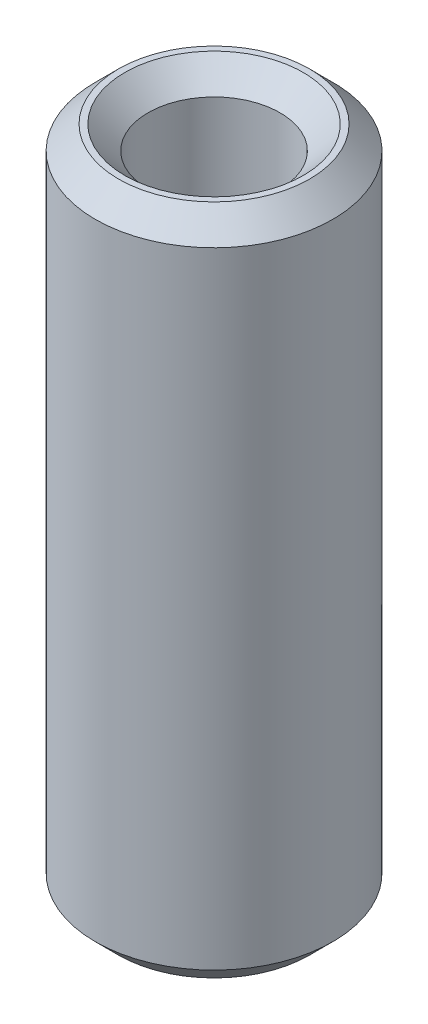
ISO-10303-21;
HEADER;
FILE_DESCRIPTION(('STEP AP214'),'2;1');
FILE_NAME('part.step','',(''),(''),'','','');
FILE_SCHEMA(('AUTOMOTIVE_DESIGN { 1 0 10303 214 1 1 1 1 }'));
ENDSEC;
DATA;
#1=APPLICATION_CONTEXT('core data for automotive mechanical design processes');
#2=APPLICATION_PROTOCOL_DEFINITION('international standard','automotive_design',2000,#1);
#3=PRODUCT_CONTEXT('',#1,'mechanical');
#4=PRODUCT('Part','Part','',(#3));
#5=PRODUCT_RELATED_PRODUCT_CATEGORY('part','',(#4));
#6=PRODUCT_DEFINITION_FORMATION('','',#4);
#7=PRODUCT_DEFINITION_CONTEXT('part definition',#1,'design');
#8=PRODUCT_DEFINITION('design','',#6,#7);
#9=PRODUCT_DEFINITION_SHAPE('','',#8);
#10=(LENGTH_UNIT() NAMED_UNIT(*) SI_UNIT(.MILLI.,.METRE.));
#11=(NAMED_UNIT(*) PLANE_ANGLE_UNIT() SI_UNIT($,.RADIAN.));
#12=(NAMED_UNIT(*) SI_UNIT($,.STERADIAN.) SOLID_ANGLE_UNIT());
#13=UNCERTAINTY_MEASURE_WITH_UNIT(LENGTH_MEASURE(1.E-05),#10,'distance_accuracy_value','');
#14=(GEOMETRIC_REPRESENTATION_CONTEXT(3) GLOBAL_UNCERTAINTY_ASSIGNED_CONTEXT((#13)) GLOBAL_UNIT_ASSIGNED_CONTEXT((#10,
#11,#12)) REPRESENTATION_CONTEXT('',''));
#15=CARTESIAN_POINT('',(0.,0.,0.));
#16=DIRECTION('',(0.,0.,1.));
#17=DIRECTION('',(1.,0.,0.));
#18=AXIS2_PLACEMENT_3D('',#15,#16,#17);
#19=CARTESIAN_POINT('',(0.,70.7418132792242,0.));
#20=DIRECTION('',(0.,-1.,0.));
#21=DIRECTION('',(0.,0.,-1.));
#22=AXIS2_PLACEMENT_3D('',#19,#20,#21);
#23=CYLINDRICAL_SURFACE('',#22,12.5);
#24=CARTESIAN_POINT('',(0.,2.44785103245802,0.));
#25=DIRECTION('',(0.,1.,0.));
#26=DIRECTION('',(0.,0.,1.));
#27=AXIS2_PLACEMENT_3D('',#24,#25,#26);
#28=CIRCLE('',#27,12.5);
#29=CARTESIAN_POINT('',(0.,2.44785103245802,12.5));
#30=VERTEX_POINT('',#29);
#31=EDGE_CURVE('E10',#30,#30,#28,.T.);
#32=ORIENTED_EDGE('',*,*,#31,.T.);
#33=EDGE_LOOP('',(#32));
#34=FACE_BOUND('',#33,.T.);
#35=CARTESIAN_POINT('',(0.,68.2939622467661,0.));
#36=DIRECTION('',(0.,1.,0.));
#37=DIRECTION('',(0.,0.,1.));
#38=AXIS2_PLACEMENT_3D('',#35,#36,#37);
#39=CIRCLE('',#38,12.5);
#40=CARTESIAN_POINT('',(0.,68.2939622467661,12.5));
#41=VERTEX_POINT('',#40);
#42=EDGE_CURVE('E50',#41,#41,#39,.F.);
#43=ORIENTED_EDGE('',*,*,#42,.T.);
#44=EDGE_LOOP('',(#43));
#45=FACE_BOUND('',#44,.T.);
#46=ADVANCED_FACE('F39',(#34,#45),#23,.T.);
#47=CARTESIAN_POINT('',(0.,70.7418132792242,0.));
#48=DIRECTION('',(0.,1.,0.));
#49=DIRECTION('',(0.,0.,1.));
#50=AXIS2_PLACEMENT_3D('',#47,#48,#49);
#51=PLANE('',#50);
#52=CARTESIAN_POINT('',(0.,70.7418132792242,0.));
#53=DIRECTION('',(0.,1.,0.));
#54=DIRECTION('',(0.,0.,1.));
#55=AXIS2_PLACEMENT_3D('',#52,#53,#54);
#56=CIRCLE('',#55,9.39648531971968);
#57=CARTESIAN_POINT('',(0.,70.7418132792242,9.39648531971968));
#58=VERTEX_POINT('',#57);
#59=EDGE_CURVE('E58',#58,#58,#56,.F.);
#60=ORIENTED_EDGE('',*,*,#59,.T.);
#61=EDGE_LOOP('',(#60));
#62=FACE_BOUND('',#61,.T.);
#63=CARTESIAN_POINT('',(0.,70.7418132792242,0.));
#64=DIRECTION('',(0.,1.,0.));
#65=DIRECTION('',(0.,0.,1.));
#66=AXIS2_PLACEMENT_3D('',#63,#64,#65);
#67=CIRCLE('',#66,10.052148967542);
#68=CARTESIAN_POINT('',(0.,70.7418132792242,10.052148967542));
#69=VERTEX_POINT('',#68);
#70=EDGE_CURVE('E61',#69,#69,#67,.T.);
#71=ORIENTED_EDGE('',*,*,#70,.T.);
#72=EDGE_LOOP('',(#71));
#73=FACE_BOUND('',#72,.T.);
#74=ADVANCED_FACE('F88',(#62,#73),#51,.T.);
#75=CARTESIAN_POINT('',(0.,0.,0.));
#76=DIRECTION('',(0.,1.,0.));
#77=DIRECTION('',(0.,0.,1.));
#78=AXIS2_PLACEMENT_3D('',#75,#76,#77);
#79=PLANE('',#78);
#80=CARTESIAN_POINT('',(0.,0.,0.));
#81=DIRECTION('',(0.,1.,0.));
#82=DIRECTION('',(0.,0.,1.));
#83=AXIS2_PLACEMENT_3D('',#80,#81,#82);
#84=CIRCLE('',#83,9.39648531971968);
#85=CARTESIAN_POINT('',(0.,0.,9.39648531971968));
#86=VERTEX_POINT('',#85);
#87=EDGE_CURVE('E51',#86,#86,#84,.T.);
#88=ORIENTED_EDGE('',*,*,#87,.T.);
#89=EDGE_LOOP('',(#88));
#90=FACE_BOUND('',#89,.T.);
#91=CARTESIAN_POINT('',(0.,0.,0.));
#92=DIRECTION('',(0.,1.,0.));
#93=DIRECTION('',(0.,0.,1.));
#94=AXIS2_PLACEMENT_3D('',#91,#92,#93);
#95=CIRCLE('',#94,10.052148967542);
#96=CARTESIAN_POINT('',(0.,0.,10.052148967542));
#97=VERTEX_POINT('',#96);
#98=EDGE_CURVE('E54',#97,#97,#95,.F.);
#99=ORIENTED_EDGE('',*,*,#98,.T.);
#100=EDGE_LOOP('',(#99));
#101=FACE_BOUND('',#100,.T.);
#102=ADVANCED_FACE('F83',(#90,#101),#79,.F.);
#103=CARTESIAN_POINT('',(0.,70.7418132792242,0.));
#104=DIRECTION('',(0.,-1.,0.));
#105=DIRECTION('',(0.,0.,-1.));
#106=AXIS2_PLACEMENT_3D('',#103,#104,#105);
#107=CYLINDRICAL_SURFACE('',#106,6.94863428726163);
#108=CARTESIAN_POINT('',(0.,68.2939622467662,0.));
#109=DIRECTION('',(0.,1.,0.));
#110=DIRECTION('',(0.,0.,1.));
#111=AXIS2_PLACEMENT_3D('',#108,#109,#110);
#112=CIRCLE('',#111,6.94863428726163);
#113=CARTESIAN_POINT('',(0.,68.2939622467662,6.94863428726163));
#114=VERTEX_POINT('',#113);
#115=EDGE_CURVE('E67',#114,#114,#112,.T.);
#116=ORIENTED_EDGE('',*,*,#115,.T.);
#117=EDGE_LOOP('',(#116));
#118=FACE_BOUND('',#117,.T.);
#119=CARTESIAN_POINT('',(0.,2.44785103245808,0.));
#120=DIRECTION('',(0.,1.,0.));
#121=DIRECTION('',(0.,0.,1.));
#122=AXIS2_PLACEMENT_3D('',#119,#120,#121);
#123=CIRCLE('',#122,6.94863428726163);
#124=CARTESIAN_POINT('',(0.,2.44785103245808,6.94863428726163));
#125=VERTEX_POINT('',#124);
#126=EDGE_CURVE('E69',#125,#125,#123,.F.);
#127=ORIENTED_EDGE('',*,*,#126,.T.);
#128=EDGE_LOOP('',(#127));
#129=FACE_BOUND('',#128,.T.);
#130=ADVANCED_FACE('F71',(#118,#129),#107,.F.);
#131=CARTESIAN_POINT('',(0.,68.2939622467662,0.));
#132=DIRECTION('',(0.,1.,0.));
#133=DIRECTION('',(0.,0.,1.));
#134=AXIS2_PLACEMENT_3D('',#131,#132,#133);
#135=CONICAL_SURFACE('',#134,6.94863428726163,0.785398163397456);
#136=ORIENTED_EDGE('',*,*,#59,.F.);
#137=EDGE_LOOP('',(#136));
#138=FACE_BOUND('',#137,.T.);
#139=ORIENTED_EDGE('',*,*,#115,.F.);
#140=EDGE_LOOP('',(#139));
#141=FACE_BOUND('',#140,.T.);
#142=ADVANCED_FACE('F77',(#138,#141),#135,.F.);
#143=CARTESIAN_POINT('',(0.,0.,0.));
#144=DIRECTION('',(0.,-1.,0.));
#145=DIRECTION('',(0.,0.,-1.));
#146=AXIS2_PLACEMENT_3D('',#143,#144,#145);
#147=CONICAL_SURFACE('',#146,9.39648531971968,0.785398163397443);
#148=ORIENTED_EDGE('',*,*,#126,.F.);
#149=EDGE_LOOP('',(#148));
#150=FACE_BOUND('',#149,.T.);
#151=ORIENTED_EDGE('',*,*,#87,.F.);
#152=EDGE_LOOP('',(#151));
#153=FACE_BOUND('',#152,.T.);
#154=ADVANCED_FACE('F73',(#150,#153),#147,.F.);
#155=CARTESIAN_POINT('',(0.,2.44785103245802,0.));
#156=DIRECTION('',(0.,1.,0.));
#157=DIRECTION('',(0.,0.,1.));
#158=AXIS2_PLACEMENT_3D('',#155,#156,#157);
#159=CONICAL_SURFACE('',#158,12.5,0.785398163397451);
#160=ORIENTED_EDGE('',*,*,#98,.F.);
#161=EDGE_LOOP('',(#160));
#162=FACE_BOUND('',#161,.T.);
#163=ORIENTED_EDGE('',*,*,#31,.F.);
#164=EDGE_LOOP('',(#163));
#165=FACE_BOUND('',#164,.T.);
#166=ADVANCED_FACE('F76',(#162,#165),#159,.T.);
#167=CARTESIAN_POINT('',(0.,70.7418132792242,0.));
#168=DIRECTION('',(0.,-1.,0.));
#169=DIRECTION('',(0.,0.,-1.));
#170=AXIS2_PLACEMENT_3D('',#167,#168,#169);
#171=CONICAL_SURFACE('',#170,10.052148967542,0.785398163397444);
#172=ORIENTED_EDGE('',*,*,#42,.F.);
#173=EDGE_LOOP('',(#172));
#174=FACE_BOUND('',#173,.T.);
#175=ORIENTED_EDGE('',*,*,#70,.F.);
#176=EDGE_LOOP('',(#175));
#177=FACE_BOUND('',#176,.T.);
#178=ADVANCED_FACE('F45',(#174,#177),#171,.T.);
#179=CLOSED_SHELL('',(#46,#74,#102,#130,#142,#154,#166,#178));
#180=MANIFOLD_SOLID_BREP('B2',#179);
#181=ADVANCED_BREP_SHAPE_REPRESENTATION('',(#18,#180),#14);
#182=SHAPE_DEFINITION_REPRESENTATION(#9,#181);
ENDSEC;
END-ISO-10303-21;
